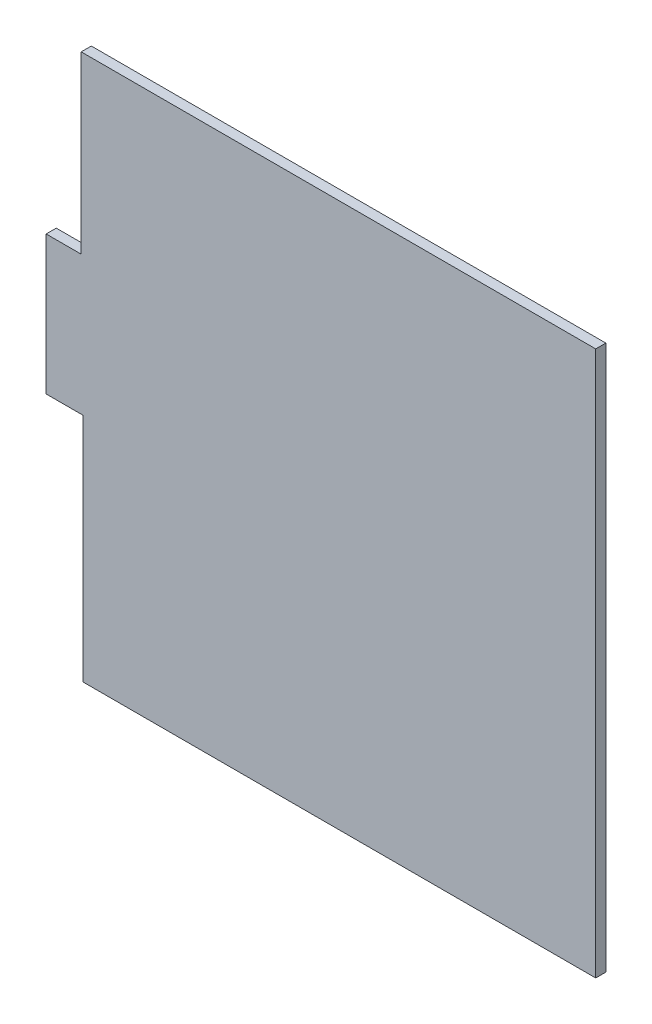
ISO-10303-21;
HEADER;
FILE_DESCRIPTION(('STEP AP214'),'2;1');
FILE_NAME('part.step','',(''),(''),'','','');
FILE_SCHEMA(('AUTOMOTIVE_DESIGN { 1 0 10303 214 1 1 1 1 }'));
ENDSEC;
DATA;
#1=APPLICATION_CONTEXT('core data for automotive mechanical design processes');
#2=APPLICATION_PROTOCOL_DEFINITION('international standard','automotive_design',2000,#1);
#3=PRODUCT_CONTEXT('',#1,'mechanical');
#4=PRODUCT('Part','Part','',(#3));
#5=PRODUCT_RELATED_PRODUCT_CATEGORY('part','',(#4));
#6=PRODUCT_DEFINITION_FORMATION('','',#4);
#7=PRODUCT_DEFINITION_CONTEXT('part definition',#1,'design');
#8=PRODUCT_DEFINITION('design','',#6,#7);
#9=PRODUCT_DEFINITION_SHAPE('','',#8);
#10=(LENGTH_UNIT() NAMED_UNIT(*) SI_UNIT(.MILLI.,.METRE.));
#11=(NAMED_UNIT(*) PLANE_ANGLE_UNIT() SI_UNIT($,.RADIAN.));
#12=(NAMED_UNIT(*) SI_UNIT($,.STERADIAN.) SOLID_ANGLE_UNIT());
#13=UNCERTAINTY_MEASURE_WITH_UNIT(LENGTH_MEASURE(1.E-05),#10,'distance_accuracy_value','');
#14=(GEOMETRIC_REPRESENTATION_CONTEXT(3) GLOBAL_UNCERTAINTY_ASSIGNED_CONTEXT((#13)) GLOBAL_UNIT_ASSIGNED_CONTEXT((#10,
#11,#12)) REPRESENTATION_CONTEXT('',''));
#15=CARTESIAN_POINT('',(0.,0.,0.));
#16=DIRECTION('',(0.,0.,1.));
#17=DIRECTION('',(1.,0.,0.));
#18=AXIS2_PLACEMENT_3D('',#15,#16,#17);
#19=CARTESIAN_POINT('',(731.320358487498,600.065863270593,-6.35));
#20=DIRECTION('',(0.,1.,0.));
#21=DIRECTION('',(0.,0.,1.));
#22=AXIS2_PLACEMENT_3D('',#19,#20,#21);
#23=PLANE('',#22);
#24=DIRECTION('',(-1.,0.,0.));
#25=VECTOR('',#24,1.);
#26=CARTESIAN_POINT('',(731.320358487498,600.065863270593,0.));
#27=LINE('',#26,#25);
#28=CARTESIAN_POINT('',(731.320358487498,600.065863270593,0.));
#29=VERTEX_POINT('',#28);
#30=CARTESIAN_POINT('',(408.320358487498,600.065863270593,0.));
#31=VERTEX_POINT('',#30);
#32=EDGE_CURVE('E133',#29,#31,#27,.T.);
#33=ORIENTED_EDGE('',*,*,#32,.F.);
#34=DIRECTION('',(0.,0.,1.));
#35=VECTOR('',#34,1.);
#36=CARTESIAN_POINT('',(731.320358487498,600.065863270593,-6.35));
#37=LINE('',#36,#35);
#38=CARTESIAN_POINT('',(731.320358487498,600.065863270593,-6.35));
#39=VERTEX_POINT('',#38);
#40=EDGE_CURVE('E11',#39,#29,#37,.T.);
#41=ORIENTED_EDGE('',*,*,#40,.F.);
#42=DIRECTION('',(-1.,0.,0.));
#43=VECTOR('',#42,1.);
#44=CARTESIAN_POINT('',(731.320358487498,600.065863270593,-6.35));
#45=LINE('',#44,#43);
#46=CARTESIAN_POINT('',(408.320358487498,600.065863270593,-6.35));
#47=VERTEX_POINT('',#46);
#48=EDGE_CURVE('E152',#39,#47,#45,.T.);
#49=ORIENTED_EDGE('',*,*,#48,.T.);
#50=DIRECTION('',(0.,0.,1.));
#51=VECTOR('',#50,1.);
#52=CARTESIAN_POINT('',(408.320358487498,600.065863270593,-6.35));
#53=LINE('',#52,#51);
#54=EDGE_CURVE('E40',#47,#31,#53,.T.);
#55=ORIENTED_EDGE('',*,*,#54,.T.);
#56=EDGE_LOOP('',(#33,#41,#49,#55));
#57=FACE_BOUND('',#56,.T.);
#58=ADVANCED_FACE('F37',(#57),#23,.T.);
#59=CARTESIAN_POINT('',(731.320358487498,258.065863270593,-6.35));
#60=DIRECTION('',(1.,0.,0.));
#61=DIRECTION('',(0.,0.,-1.));
#62=AXIS2_PLACEMENT_3D('',#59,#60,#61);
#63=PLANE('',#62);
#64=DIRECTION('',(0.,1.,0.));
#65=VECTOR('',#64,1.);
#66=CARTESIAN_POINT('',(731.320358487498,258.065863270593,0.));
#67=LINE('',#66,#65);
#68=CARTESIAN_POINT('',(731.320358487498,258.065863270593,0.));
#69=VERTEX_POINT('',#68);
#70=EDGE_CURVE('E150',#69,#29,#67,.T.);
#71=ORIENTED_EDGE('',*,*,#70,.F.);
#72=DIRECTION('',(0.,0.,1.));
#73=VECTOR('',#72,1.);
#74=CARTESIAN_POINT('',(731.320358487498,258.065863270593,-6.35));
#75=LINE('',#74,#73);
#76=CARTESIAN_POINT('',(731.320358487498,258.065863270593,-6.35));
#77=VERTEX_POINT('',#76);
#78=EDGE_CURVE('E46',#77,#69,#75,.T.);
#79=ORIENTED_EDGE('',*,*,#78,.F.);
#80=DIRECTION('',(0.,1.,0.));
#81=VECTOR('',#80,1.);
#82=CARTESIAN_POINT('',(731.320358487498,258.065863270593,-6.35));
#83=LINE('',#82,#81);
#84=EDGE_CURVE('E114',#77,#39,#83,.T.);
#85=ORIENTED_EDGE('',*,*,#84,.T.);
#86=ORIENTED_EDGE('',*,*,#40,.T.);
#87=EDGE_LOOP('',(#71,#79,#85,#86));
#88=FACE_BOUND('',#87,.T.);
#89=ADVANCED_FACE('F165',(#88),#63,.T.);
#90=CARTESIAN_POINT('',(731.320358487498,258.065863270593,-6.35));
#91=DIRECTION('',(0.,1.,0.));
#92=DIRECTION('',(0.,0.,1.));
#93=AXIS2_PLACEMENT_3D('',#90,#91,#92);
#94=PLANE('',#93);
#95=DIRECTION('',(-1.,0.,0.));
#96=VECTOR('',#95,1.);
#97=CARTESIAN_POINT('',(731.320358487498,258.065863270593,0.));
#98=LINE('',#97,#96);
#99=CARTESIAN_POINT('',(409.320358487498,258.065863270593,0.));
#100=VERTEX_POINT('',#99);
#101=EDGE_CURVE('E118',#69,#100,#98,.T.);
#102=ORIENTED_EDGE('',*,*,#101,.T.);
#103=DIRECTION('',(0.,0.,1.));
#104=VECTOR('',#103,1.);
#105=CARTESIAN_POINT('',(409.320358487498,258.065863270593,-6.35));
#106=LINE('',#105,#104);
#107=CARTESIAN_POINT('',(409.320358487498,258.065863270593,-6.35));
#108=VERTEX_POINT('',#107);
#109=EDGE_CURVE('E116',#108,#100,#106,.T.);
#110=ORIENTED_EDGE('',*,*,#109,.F.);
#111=DIRECTION('',(-1.,0.,0.));
#112=VECTOR('',#111,1.);
#113=CARTESIAN_POINT('',(731.320358487498,258.065863270593,-6.35));
#114=LINE('',#113,#112);
#115=EDGE_CURVE('E109',#77,#108,#114,.T.);
#116=ORIENTED_EDGE('',*,*,#115,.F.);
#117=ORIENTED_EDGE('',*,*,#78,.T.);
#118=EDGE_LOOP('',(#102,#110,#116,#117));
#119=FACE_BOUND('',#118,.T.);
#120=ADVANCED_FACE('F117',(#119),#94,.F.);
#121=CARTESIAN_POINT('',(409.320358487498,403.065863270593,-6.35));
#122=DIRECTION('',(-1.,0.,0.));
#123=DIRECTION('',(0.,-1.,0.));
#124=AXIS2_PLACEMENT_3D('',#121,#122,#123);
#125=PLANE('',#124);
#126=DIRECTION('',(0.,-1.,0.));
#127=VECTOR('',#126,1.);
#128=CARTESIAN_POINT('',(409.320358487498,403.065863270593,0.));
#129=LINE('',#128,#127);
#130=CARTESIAN_POINT('',(409.320358487498,403.065863270593,0.));
#131=VERTEX_POINT('',#130);
#132=EDGE_CURVE('E147',#131,#100,#129,.T.);
#133=ORIENTED_EDGE('',*,*,#132,.F.);
#134=DIRECTION('',(0.,0.,1.));
#135=VECTOR('',#134,1.);
#136=CARTESIAN_POINT('',(409.320358487498,403.065863270593,-6.35));
#137=LINE('',#136,#135);
#138=CARTESIAN_POINT('',(409.320358487498,403.065863270593,-6.35));
#139=VERTEX_POINT('',#138);
#140=EDGE_CURVE('E122',#139,#131,#137,.T.);
#141=ORIENTED_EDGE('',*,*,#140,.F.);
#142=DIRECTION('',(0.,-1.,0.));
#143=VECTOR('',#142,1.);
#144=CARTESIAN_POINT('',(409.320358487498,403.065863270593,-6.35));
#145=LINE('',#144,#143);
#146=EDGE_CURVE('E113',#139,#108,#145,.T.);
#147=ORIENTED_EDGE('',*,*,#146,.T.);
#148=ORIENTED_EDGE('',*,*,#109,.T.);
#149=EDGE_LOOP('',(#133,#141,#147,#148));
#150=FACE_BOUND('',#149,.T.);
#151=ADVANCED_FACE('F124',(#150),#125,.T.);
#152=CARTESIAN_POINT('',(409.320358487498,403.065863270593,-6.35));
#153=DIRECTION('',(0.,1.,0.));
#154=DIRECTION('',(0.,0.,1.));
#155=AXIS2_PLACEMENT_3D('',#152,#153,#154);
#156=PLANE('',#155);
#157=DIRECTION('',(-1.,0.,0.));
#158=VECTOR('',#157,1.);
#159=CARTESIAN_POINT('',(409.320358487498,403.065863270593,0.));
#160=LINE('',#159,#158);
#161=CARTESIAN_POINT('',(386.320358487498,403.065863270593,0.));
#162=VERTEX_POINT('',#161);
#163=EDGE_CURVE('E145',#131,#162,#160,.T.);
#164=ORIENTED_EDGE('',*,*,#163,.T.);
#165=DIRECTION('',(0.,0.,1.));
#166=VECTOR('',#165,1.);
#167=CARTESIAN_POINT('',(386.320358487498,403.065863270593,-6.35));
#168=LINE('',#167,#166);
#169=CARTESIAN_POINT('',(386.320358487498,403.065863270593,-6.35));
#170=VERTEX_POINT('',#169);
#171=EDGE_CURVE('E156',#170,#162,#168,.T.);
#172=ORIENTED_EDGE('',*,*,#171,.F.);
#173=DIRECTION('',(-1.,0.,0.));
#174=VECTOR('',#173,1.);
#175=CARTESIAN_POINT('',(409.320358487498,403.065863270593,-6.35));
#176=LINE('',#175,#174);
#177=EDGE_CURVE('E126',#139,#170,#176,.T.);
#178=ORIENTED_EDGE('',*,*,#177,.F.);
#179=ORIENTED_EDGE('',*,*,#140,.T.);
#180=EDGE_LOOP('',(#164,#172,#178,#179));
#181=FACE_BOUND('',#180,.T.);
#182=ADVANCED_FACE('F178',(#181),#156,.F.);
#183=CARTESIAN_POINT('',(386.320358487498,403.065863270593,-6.35));
#184=DIRECTION('',(1.,0.,0.));
#185=DIRECTION('',(0.,0.,-1.));
#186=AXIS2_PLACEMENT_3D('',#183,#184,#185);
#187=PLANE('',#186);
#188=DIRECTION('',(0.,1.,0.));
#189=VECTOR('',#188,1.);
#190=CARTESIAN_POINT('',(386.320358487498,403.065863270593,0.));
#191=LINE('',#190,#189);
#192=CARTESIAN_POINT('',(386.320358487498,490.065863270593,0.));
#193=VERTEX_POINT('',#192);
#194=EDGE_CURVE('E142',#162,#193,#191,.T.);
#195=ORIENTED_EDGE('',*,*,#194,.T.);
#196=DIRECTION('',(0.,0.,1.));
#197=VECTOR('',#196,1.);
#198=CARTESIAN_POINT('',(386.320358487498,490.065863270593,-6.35));
#199=LINE('',#198,#197);
#200=CARTESIAN_POINT('',(386.320358487498,490.065863270593,-6.35));
#201=VERTEX_POINT('',#200);
#202=EDGE_CURVE('E159',#201,#193,#199,.T.);
#203=ORIENTED_EDGE('',*,*,#202,.F.);
#204=DIRECTION('',(0.,1.,0.));
#205=VECTOR('',#204,1.);
#206=CARTESIAN_POINT('',(386.320358487498,403.065863270593,-6.35));
#207=LINE('',#206,#205);
#208=EDGE_CURVE('E128',#170,#201,#207,.T.);
#209=ORIENTED_EDGE('',*,*,#208,.F.);
#210=ORIENTED_EDGE('',*,*,#171,.T.);
#211=EDGE_LOOP('',(#195,#203,#209,#210));
#212=FACE_BOUND('',#211,.T.);
#213=ADVANCED_FACE('F181',(#212),#187,.F.);
#214=CARTESIAN_POINT('',(408.320358487498,490.065863270593,-6.35));
#215=DIRECTION('',(0.,1.,0.));
#216=DIRECTION('',(0.,0.,1.));
#217=AXIS2_PLACEMENT_3D('',#214,#215,#216);
#218=PLANE('',#217);
#219=DIRECTION('',(-1.,0.,0.));
#220=VECTOR('',#219,1.);
#221=CARTESIAN_POINT('',(408.320358487498,490.065863270593,0.));
#222=LINE('',#221,#220);
#223=CARTESIAN_POINT('',(408.320358487498,490.065863270593,0.));
#224=VERTEX_POINT('',#223);
#225=EDGE_CURVE('E139',#224,#193,#222,.T.);
#226=ORIENTED_EDGE('',*,*,#225,.F.);
#227=DIRECTION('',(0.,0.,1.));
#228=VECTOR('',#227,1.);
#229=CARTESIAN_POINT('',(408.320358487498,490.065863270593,-6.35));
#230=LINE('',#229,#228);
#231=CARTESIAN_POINT('',(408.320358487498,490.065863270593,-6.35));
#232=VERTEX_POINT('',#231);
#233=EDGE_CURVE('E160',#232,#224,#230,.T.);
#234=ORIENTED_EDGE('',*,*,#233,.F.);
#235=DIRECTION('',(-1.,0.,0.));
#236=VECTOR('',#235,1.);
#237=CARTESIAN_POINT('',(408.320358487498,490.065863270593,-6.35));
#238=LINE('',#237,#236);
#239=EDGE_CURVE('E277',#232,#201,#238,.T.);
#240=ORIENTED_EDGE('',*,*,#239,.T.);
#241=ORIENTED_EDGE('',*,*,#202,.T.);
#242=EDGE_LOOP('',(#226,#234,#240,#241));
#243=FACE_BOUND('',#242,.T.);
#244=ADVANCED_FACE('F185',(#243),#218,.T.);
#245=CARTESIAN_POINT('',(408.320358487498,600.065863270593,-6.35));
#246=DIRECTION('',(-1.,0.,0.));
#247=DIRECTION('',(0.,0.,1.));
#248=AXIS2_PLACEMENT_3D('',#245,#246,#247);
#249=PLANE('',#248);
#250=DIRECTION('',(0.,-1.,0.));
#251=VECTOR('',#250,1.);
#252=CARTESIAN_POINT('',(408.320358487498,600.065863270593,0.));
#253=LINE('',#252,#251);
#254=EDGE_CURVE('E136',#31,#224,#253,.T.);
#255=ORIENTED_EDGE('',*,*,#254,.F.);
#256=ORIENTED_EDGE('',*,*,#54,.F.);
#257=DIRECTION('',(0.,-1.,0.));
#258=VECTOR('',#257,1.);
#259=CARTESIAN_POINT('',(408.320358487498,600.065863270593,-6.35));
#260=LINE('',#259,#258);
#261=EDGE_CURVE('E278',#47,#232,#260,.T.);
#262=ORIENTED_EDGE('',*,*,#261,.T.);
#263=ORIENTED_EDGE('',*,*,#233,.T.);
#264=EDGE_LOOP('',(#255,#256,#262,#263));
#265=FACE_BOUND('',#264,.T.);
#266=ADVANCED_FACE('F162',(#265),#249,.T.);
#267=CARTESIAN_POINT('',(0.,0.,-6.35));
#268=DIRECTION('',(0.,0.,1.));
#269=DIRECTION('',(1.,0.,0.));
#270=AXIS2_PLACEMENT_3D('',#267,#268,#269);
#271=PLANE('',#270);
#272=ORIENTED_EDGE('',*,*,#48,.F.);
#273=ORIENTED_EDGE('',*,*,#84,.F.);
#274=ORIENTED_EDGE('',*,*,#115,.T.);
#275=ORIENTED_EDGE('',*,*,#146,.F.);
#276=ORIENTED_EDGE('',*,*,#177,.T.);
#277=ORIENTED_EDGE('',*,*,#208,.T.);
#278=ORIENTED_EDGE('',*,*,#239,.F.);
#279=ORIENTED_EDGE('',*,*,#261,.F.);
#280=EDGE_LOOP('',(#272,#273,#274,#275,#276,#277,#278,#279));
#281=FACE_BOUND('',#280,.T.);
#282=ADVANCED_FACE('F111',(#281),#271,.F.);
#283=CARTESIAN_POINT('',(0.,0.,0.));
#284=DIRECTION('',(0.,0.,1.));
#285=DIRECTION('',(1.,0.,0.));
#286=AXIS2_PLACEMENT_3D('',#283,#284,#285);
#287=PLANE('',#286);
#288=ORIENTED_EDGE('',*,*,#32,.T.);
#289=ORIENTED_EDGE('',*,*,#254,.T.);
#290=ORIENTED_EDGE('',*,*,#225,.T.);
#291=ORIENTED_EDGE('',*,*,#194,.F.);
#292=ORIENTED_EDGE('',*,*,#163,.F.);
#293=ORIENTED_EDGE('',*,*,#132,.T.);
#294=ORIENTED_EDGE('',*,*,#101,.F.);
#295=ORIENTED_EDGE('',*,*,#70,.T.);
#296=EDGE_LOOP('',(#288,#289,#290,#291,#292,#293,#294,#295));
#297=FACE_BOUND('',#296,.T.);
#298=ADVANCED_FACE('F164',(#297),#287,.T.);
#299=CLOSED_SHELL('',(#58,#89,#120,#151,#182,#213,#244,#266,#282,#298));
#300=MANIFOLD_SOLID_BREP('B2',#299);
#301=ADVANCED_BREP_SHAPE_REPRESENTATION('',(#18,#300),#14);
#302=SHAPE_DEFINITION_REPRESENTATION(#9,#301);
ENDSEC;
END-ISO-10303-21;
